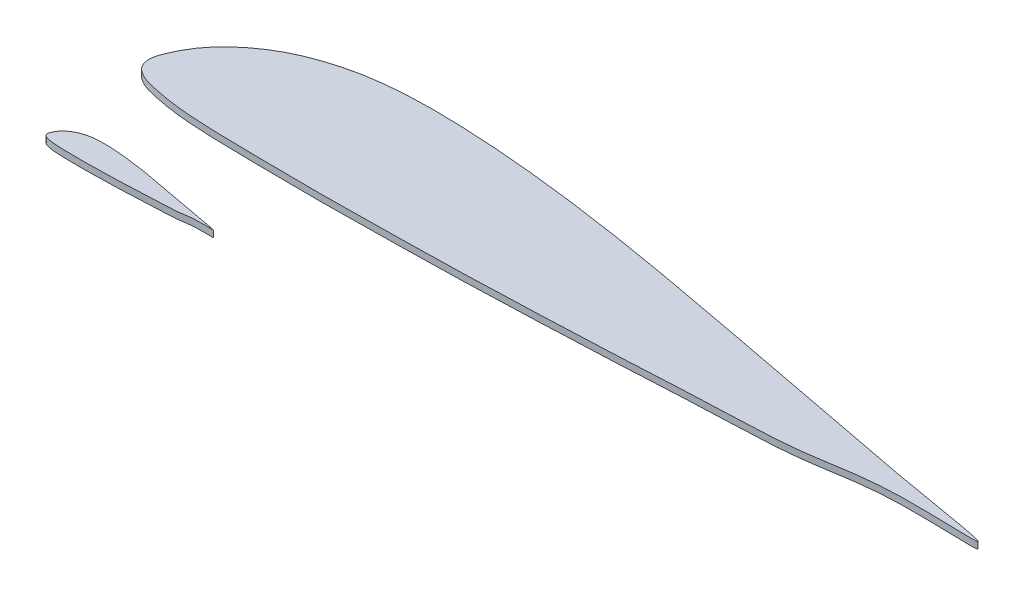
ISO-10303-21;
HEADER;
FILE_DESCRIPTION(('STEP AP214'),'2;1');
FILE_NAME('part.step','',(''),(''),'','','');
FILE_SCHEMA(('AUTOMOTIVE_DESIGN { 1 0 10303 214 1 1 1 1 }'));
ENDSEC;
DATA;
#1=APPLICATION_CONTEXT('core data for automotive mechanical design processes');
#2=APPLICATION_PROTOCOL_DEFINITION('international standard','automotive_design',2000,#1);
#3=PRODUCT_CONTEXT('',#1,'mechanical');
#4=PRODUCT('Part','Part','',(#3));
#5=PRODUCT_RELATED_PRODUCT_CATEGORY('part','',(#4));
#6=PRODUCT_DEFINITION_FORMATION('','',#4);
#7=PRODUCT_DEFINITION_CONTEXT('part definition',#1,'design');
#8=PRODUCT_DEFINITION('design','',#6,#7);
#9=PRODUCT_DEFINITION_SHAPE('','',#8);
#10=(LENGTH_UNIT() NAMED_UNIT(*) SI_UNIT(.MILLI.,.METRE.));
#11=(NAMED_UNIT(*) PLANE_ANGLE_UNIT() SI_UNIT($,.RADIAN.));
#12=(NAMED_UNIT(*) SI_UNIT($,.STERADIAN.) SOLID_ANGLE_UNIT());
#13=UNCERTAINTY_MEASURE_WITH_UNIT(LENGTH_MEASURE(1.E-05),#10,'distance_accuracy_value','');
#14=(GEOMETRIC_REPRESENTATION_CONTEXT(3) GLOBAL_UNCERTAINTY_ASSIGNED_CONTEXT((#13)) GLOBAL_UNIT_ASSIGNED_CONTEXT((#10,
#11,#12)) REPRESENTATION_CONTEXT('',''));
#15=CARTESIAN_POINT('',(0.,0.,0.));
#16=DIRECTION('',(0.,0.,1.));
#17=DIRECTION('',(1.,0.,0.));
#18=AXIS2_PLACEMENT_3D('',#15,#16,#17);
#19=CARTESIAN_POINT('',(492.,4.,-67.652117248356));
#20=CARTESIAN_POINT('',(492.314162404536,4.,-68.9072947029402));
#21=CARTESIAN_POINT('',(434.11891486913,4.,-78.0379749723945));
#22=CARTESIAN_POINT('',(394.11255435124,4.,-86.4188490323449));
#23=CARTESIAN_POINT('',(341.430867725912,4.,-96.1993323883618));
#24=CARTESIAN_POINT('',(292.193323671576,4.,-105.690867303714));
#25=CARTESIAN_POINT('',(242.083690153981,4.,-114.896091704618));
#26=CARTESIAN_POINT('',(192.163234967044,4.,-122.522241267517));
#27=CARTESIAN_POINT('',(150.407211882061,4.,-126.940203416063));
#28=CARTESIAN_POINT('',(117.018664623287,4.,-128.746128415345));
#29=CARTESIAN_POINT('',(91.956436712477,4.,-128.931625600867));
#30=CARTESIAN_POINT('',(66.6601337223384,4.,-126.809743558928));
#31=CARTESIAN_POINT('',(44.7634945351673,4.,-121.238091304056));
#32=CARTESIAN_POINT('',(28.1300732897793,4.,-113.97345871328));
#33=CARTESIAN_POINT('',(16.4707140551661,4.,-106.356619078859));
#34=CARTESIAN_POINT('',(8.13658587734449,4.,-99.162460727744));
#35=CARTESIAN_POINT('',(1.53788652412752,4.,-91.5749918664188));
#36=CARTESIAN_POINT('',(-2.5474332570886,4.,-85.2401321343158));
#37=CARTESIAN_POINT('',(-6.44447829791774,4.,-77.4008350974978));
#38=CARTESIAN_POINT('',(-9.37346606391106,4.,-69.591903303844));
#39=CARTESIAN_POINT('',(-6.38792599083984,4.,-62.7221609510061));
#40=CARTESIAN_POINT('',(-2.3595700708408,4.,-59.8857377541895));
#41=CARTESIAN_POINT('',(1.80371536292615,4.,-57.7501062352442));
#42=CARTESIAN_POINT('',(8.62537899468902,4.,-56.0801226558703));
#43=CARTESIAN_POINT('',(16.942374292905,4.,-54.3945200412575));
#44=CARTESIAN_POINT('',(28.6294674113893,4.,-52.847968383861));
#45=CARTESIAN_POINT('',(45.3135113769382,4.,-51.7356264625013));
#46=CARTESIAN_POINT('',(66.9987158478796,4.,-51.390567635409));
#47=CARTESIAN_POINT('',(91.9985119168434,4.,-51.0621635683304));
#48=CARTESIAN_POINT('',(117.001520916576,4.,-50.9735426737419));
#49=CARTESIAN_POINT('',(150.333059134976,4.,-51.4840388146242));
#50=CARTESIAN_POINT('',(192.02270905948,4.,-52.0581032856986));
#51=CARTESIAN_POINT('',(241.968513652882,4.,-53.9125317109954));
#52=CARTESIAN_POINT('',(292.16035736171,4.,-56.0067205783753));
#53=CARTESIAN_POINT('',(341.436299225028,4.,-58.9756495911982));
#54=CARTESIAN_POINT('',(394.250908778412,4.,-60.0076382988969));
#55=CARTESIAN_POINT('',(434.087300725326,4.,-70.3569688151884));
#56=CARTESIAN_POINT('',(491.691359171975,4.,-66.4190002257326));
#57=CARTESIAN_POINT('',(492.,4.,-67.652117248356));
#58=B_SPLINE_CURVE_WITH_KNOTS('',3,(#19,#20,#21,#22,#23,#24,#25,#26,#27,#28,#29,#30,#31,#32,#33,
#34,#35,#36,#37,#38,#39,#40,#41,#42,#43,#44,#45,#46,#47,#48,#49,#50,#51,#52,#53,#54,#55,#56,
#57),.UNSPECIFIED.,.T.,.F.,(4,1,1,1,1,1,1,1,1,1,1,1,1,1,1,1,1,1,1,1,1,1,1,1,1,1,1,1,1,1,1,1,1,1,
1,1,4),(0.,0.0490408656764943,0.0980817313529888,0.147122597029483,0.196163462705978,
0.245116685545263,0.293834629256661,0.342263553193416,0.366385572960314,0.390475045746911,
0.414675268241992,0.439565651155836,0.455415352681607,0.466907823883372,0.479711554297044,
0.48709032929319,0.495936907344408,0.501323477213704,0.512663454203477,0.518310059511212,
0.521365151754157,0.526751721623454,0.531754914327112,0.541581529671993,0.551304728452871,
0.565797224363326,0.589894838016151,0.613986045182352,0.638075566147846,0.662166773314048,
0.710353523244322,0.758560308204798,0.806785868446715,0.85502500010905,0.903284914630983,
0.951821054426205,1.),.UNSPECIFIED.);
#59=DIRECTION('',(0.,-1.,0.));
#60=VECTOR('',#59,1.);
#61=SURFACE_OF_LINEAR_EXTRUSION('',#58,#60);
#62=CARTESIAN_POINT('',(492.,4.,-67.652117248356));
#63=VERTEX_POINT('',#62);
#64=EDGE_CURVE('E11',#63,#63,#58,.T.);
#65=ORIENTED_EDGE('',*,*,#64,.F.);
#66=EDGE_LOOP('',(#65));
#67=FACE_BOUND('',#66,.T.);
#68=CARTESIAN_POINT('',(492.,0.,-67.652117248356));
#69=CARTESIAN_POINT('',(492.314162404536,0.,-68.9072947029402));
#70=CARTESIAN_POINT('',(434.11891486913,0.,-78.0379749723945));
#71=CARTESIAN_POINT('',(394.11255435124,0.,-86.4188490323449));
#72=CARTESIAN_POINT('',(341.430867725912,0.,-96.1993323883618));
#73=CARTESIAN_POINT('',(292.193323671576,0.,-105.690867303714));
#74=CARTESIAN_POINT('',(242.083690153981,0.,-114.896091704618));
#75=CARTESIAN_POINT('',(192.163234967044,0.,-122.522241267517));
#76=CARTESIAN_POINT('',(150.407211882061,0.,-126.940203416063));
#77=CARTESIAN_POINT('',(117.018664623287,0.,-128.746128415345));
#78=CARTESIAN_POINT('',(91.956436712477,0.,-128.931625600867));
#79=CARTESIAN_POINT('',(66.6601337223384,0.,-126.809743558928));
#80=CARTESIAN_POINT('',(44.7634945351673,0.,-121.238091304056));
#81=CARTESIAN_POINT('',(28.1300732897793,0.,-113.97345871328));
#82=CARTESIAN_POINT('',(16.4707140551661,0.,-106.356619078859));
#83=CARTESIAN_POINT('',(8.13658587734449,0.,-99.162460727744));
#84=CARTESIAN_POINT('',(1.53788652412752,0.,-91.5749918664188));
#85=CARTESIAN_POINT('',(-2.5474332570886,0.,-85.2401321343158));
#86=CARTESIAN_POINT('',(-6.44447829791774,0.,-77.4008350974978));
#87=CARTESIAN_POINT('',(-9.37346606391106,0.,-69.591903303844));
#88=CARTESIAN_POINT('',(-6.38792599083984,0.,-62.7221609510061));
#89=CARTESIAN_POINT('',(-2.3595700708408,0.,-59.8857377541895));
#90=CARTESIAN_POINT('',(1.80371536292615,0.,-57.7501062352442));
#91=CARTESIAN_POINT('',(8.62537899468902,0.,-56.0801226558703));
#92=CARTESIAN_POINT('',(16.942374292905,0.,-54.3945200412575));
#93=CARTESIAN_POINT('',(28.6294674113893,0.,-52.847968383861));
#94=CARTESIAN_POINT('',(45.3135113769382,0.,-51.7356264625013));
#95=CARTESIAN_POINT('',(66.9987158478796,0.,-51.390567635409));
#96=CARTESIAN_POINT('',(91.9985119168434,0.,-51.0621635683304));
#97=CARTESIAN_POINT('',(117.001520916576,0.,-50.9735426737419));
#98=CARTESIAN_POINT('',(150.333059134976,0.,-51.4840388146242));
#99=CARTESIAN_POINT('',(192.02270905948,0.,-52.0581032856986));
#100=CARTESIAN_POINT('',(241.968513652882,0.,-53.9125317109954));
#101=CARTESIAN_POINT('',(292.16035736171,0.,-56.0067205783753));
#102=CARTESIAN_POINT('',(341.436299225028,0.,-58.9756495911982));
#103=CARTESIAN_POINT('',(394.250908778412,0.,-60.0076382988969));
#104=CARTESIAN_POINT('',(434.087300725326,0.,-70.3569688151884));
#105=CARTESIAN_POINT('',(491.691359171975,0.,-66.4190002257326));
#106=CARTESIAN_POINT('',(492.,0.,-67.652117248356));
#107=B_SPLINE_CURVE_WITH_KNOTS('',3,(#68,#69,#70,#71,#72,#73,#74,#75,#76,#77,#78,#79,#80,#81,
#82,#83,#84,#85,#86,#87,#88,#89,#90,#91,#92,#93,#94,#95,#96,#97,#98,#99,#100,#101,#102,#103,
#104,#105,#106),.UNSPECIFIED.,.T.,.F.,(4,1,1,1,1,1,1,1,1,1,1,1,1,1,1,1,1,1,1,1,1,1,1,1,1,1,1,1,
1,1,1,1,1,1,1,1,4),(0.,0.0490408656764943,0.0980817313529888,0.147122597029483,
0.196163462705978,0.245116685545263,0.293834629256661,0.342263553193416,0.366385572960314,
0.390475045746911,0.414675268241992,0.439565651155836,0.455415352681607,0.466907823883372,
0.479711554297044,0.48709032929319,0.495936907344408,0.501323477213704,0.512663454203477,
0.518310059511212,0.521365151754157,0.526751721623454,0.531754914327112,0.541581529671993,
0.551304728452871,0.565797224363326,0.589894838016151,0.613986045182352,0.638075566147846,
0.662166773314048,0.710353523244322,0.758560308204798,0.806785868446715,0.85502500010905,
0.903284914630983,0.951821054426205,1.),.UNSPECIFIED.);
#108=CARTESIAN_POINT('',(492.,0.,-67.652117248356));
#109=VERTEX_POINT('',#108);
#110=EDGE_CURVE('E43',#109,#109,#107,.T.);
#111=ORIENTED_EDGE('',*,*,#110,.T.);
#112=EDGE_LOOP('',(#111));
#113=FACE_BOUND('',#112,.T.);
#114=ADVANCED_FACE('F39',(#67,#113),#61,.F.);
#115=CARTESIAN_POINT('',(-4.91510725042875,4.,-80.4108952612956));
#116=DIRECTION('',(0.,-1.,0.));
#117=DIRECTION('',(0.,0.,-1.));
#118=AXIS2_PLACEMENT_3D('',#115,#116,#117);
#119=PLANE('',#118);
#120=ORIENTED_EDGE('',*,*,#64,.T.);
#121=EDGE_LOOP('',(#120));
#122=FACE_BOUND('',#121,.T.);
#123=ADVANCED_FACE('F62',(#122),#119,.F.);
#124=CARTESIAN_POINT('',(-4.91510725042875,0.,-80.4108952612956));
#125=DIRECTION('',(0.,-1.,0.));
#126=DIRECTION('',(0.,0.,-1.));
#127=AXIS2_PLACEMENT_3D('',#124,#125,#126);
#128=PLANE('',#127);
#129=ORIENTED_EDGE('',*,*,#110,.F.);
#130=EDGE_LOOP('',(#129));
#131=FACE_BOUND('',#130,.T.);
#132=ADVANCED_FACE('F60',(#131),#128,.T.);
#133=CLOSED_SHELL('',(#114,#123,#132));
#134=MANIFOLD_SOLID_BREP('B2',#133);
#135=CARTESIAN_POINT('',(100.,4.,0.));
#136=CARTESIAN_POINT('',(100.062832480907,4.,-0.251035490916847));
#137=CARTESIAN_POINT('',(88.4237829738261,4.,-2.0771715448077));
#138=CARTESIAN_POINT('',(80.4225108702479,4.,-3.75334635679778));
#139=CARTESIAN_POINT('',(69.8861735451824,4.,-5.70944302800117));
#140=CARTESIAN_POINT('',(60.0386647343152,4.,-7.60775001107157));
#141=CARTESIAN_POINT('',(50.0167380307963,4.,-9.4487948912524));
#142=CARTESIAN_POINT('',(40.0326469934087,4.,-10.9740248038323));
#143=CARTESIAN_POINT('',(31.6814423764122,4.,-11.8576172335413));
#144=CARTESIAN_POINT('',(25.0037329246573,4.,-12.2188022333978));
#145=CARTESIAN_POINT('',(19.9912873424954,4.,-12.2559016705021));
#146=CARTESIAN_POINT('',(14.9320267444677,4.,-11.8315252621144));
#147=CARTESIAN_POINT('',(10.5526989070335,4.,-10.71719481114));
#148=CARTESIAN_POINT('',(7.22601465795583,4.,-9.26426829298485));
#149=CARTESIAN_POINT('',(4.89414281103323,4.,-7.74090036610056));
#150=CARTESIAN_POINT('',(3.22731717546887,4.,-6.30206869587759));
#151=CARTESIAN_POINT('',(1.90757730482551,4.,-4.78457492361256));
#152=CARTESIAN_POINT('',(1.09051334858228,4.,-3.51760297719199));
#153=CARTESIAN_POINT('',(0.311104340416445,4.,-1.94974356982835));
#154=CARTESIAN_POINT('',(-0.274693212782225,4.,-0.38795721109765));
#155=CARTESIAN_POINT('',(0.32241480183204,4.,0.985991259469997));
#156=CARTESIAN_POINT('',(1.12808598583183,4.,1.55327589883329));
#157=CARTESIAN_POINT('',(1.96074307258525,4.,1.98040220262235));
#158=CARTESIAN_POINT('',(3.32507579893781,4.,2.31439891849714));
#159=CARTESIAN_POINT('',(4.98847485858098,4.,2.6515194414197));
#160=CARTESIAN_POINT('',(7.32589348227786,4.,2.96082977289899));
#161=CARTESIAN_POINT('',(10.6627022753876,4.,3.18329815717093));
#162=CARTESIAN_POINT('',(14.9997431695759,4.,3.25230992258939));
#163=CARTESIAN_POINT('',(19.9997023833687,4.,3.31799073600512));
#164=CARTESIAN_POINT('',(25.0003041833152,4.,3.33571491492282));
#165=CARTESIAN_POINT('',(31.6666118269951,4.,3.23361568674636));
#166=CARTESIAN_POINT('',(40.0045418118961,4.,3.11880279253148));
#167=CARTESIAN_POINT('',(49.9937027305764,4.,2.7479171074721));
#168=CARTESIAN_POINT('',(60.032071472342,4.,2.32907933399613));
#169=CARTESIAN_POINT('',(69.8872598450056,4.,1.73529353143155));
#170=CARTESIAN_POINT('',(80.4501817556825,4.,1.52889578989182));
#171=CARTESIAN_POINT('',(88.4174601450651,4.,-0.540970313366487));
#172=CARTESIAN_POINT('',(99.9382718343949,4.,0.246623404524664));
#173=CARTESIAN_POINT('',(100.,4.,0.));
#174=B_SPLINE_CURVE_WITH_KNOTS('',3,(#135,#136,#137,#138,#139,#140,#141,#142,#143,#144,#145,
#146,#147,#148,#149,#150,#151,#152,#153,#154,#155,#156,#157,#158,#159,#160,#161,#162,#163,#164,
#165,#166,#167,#168,#169,#170,#171,#172,#173),.UNSPECIFIED.,.T.,.F.,(4,1,1,1,1,1,1,1,1,1,1,1,1,
1,1,1,1,1,1,1,1,1,1,1,1,1,1,1,1,1,1,1,1,1,1,1,4),(0.,0.0490408656764944,0.0980817313529888,
0.147122597029483,0.196163462705978,0.245116685545263,0.293834629256661,0.342263553193416,
0.366385572960314,0.390475045746911,0.414675268241992,0.439565651155836,0.455415352681607,
0.466907823883372,0.479711554297043,0.48709032929319,0.495936907344408,0.501323477213704,
0.512663454203477,0.518310059511212,0.521365151754157,0.526751721623454,0.531754914327112,
0.541581529671993,0.551304728452871,0.565797224363326,0.589894838016151,0.613986045182352,
0.638075566147846,0.662166773314048,0.710353523244322,0.758560308204797,0.806785868446715,
0.85502500010905,0.903284914630982,0.951821054426205,1.),.UNSPECIFIED.);
#175=DIRECTION('',(0.,-1.,0.));
#176=VECTOR('',#175,1.);
#177=SURFACE_OF_LINEAR_EXTRUSION('',#174,#176);
#178=CARTESIAN_POINT('',(100.,4.,0.));
#179=VERTEX_POINT('',#178);
#180=EDGE_CURVE('E38',#179,#179,#174,.T.);
#181=ORIENTED_EDGE('',*,*,#180,.F.);
#182=EDGE_LOOP('',(#181));
#183=FACE_BOUND('',#182,.T.);
#184=CARTESIAN_POINT('',(100.,0.,0.));
#185=CARTESIAN_POINT('',(100.062832480907,0.,-0.251035490916847));
#186=CARTESIAN_POINT('',(88.4237829738261,0.,-2.0771715448077));
#187=CARTESIAN_POINT('',(80.4225108702479,0.,-3.75334635679778));
#188=CARTESIAN_POINT('',(69.8861735451824,0.,-5.70944302800117));
#189=CARTESIAN_POINT('',(60.0386647343152,0.,-7.60775001107157));
#190=CARTESIAN_POINT('',(50.0167380307963,0.,-9.4487948912524));
#191=CARTESIAN_POINT('',(40.0326469934087,0.,-10.9740248038323));
#192=CARTESIAN_POINT('',(31.6814423764122,0.,-11.8576172335413));
#193=CARTESIAN_POINT('',(25.0037329246573,0.,-12.2188022333978));
#194=CARTESIAN_POINT('',(19.9912873424954,0.,-12.2559016705021));
#195=CARTESIAN_POINT('',(14.9320267444677,0.,-11.8315252621144));
#196=CARTESIAN_POINT('',(10.5526989070335,0.,-10.71719481114));
#197=CARTESIAN_POINT('',(7.22601465795583,0.,-9.26426829298485));
#198=CARTESIAN_POINT('',(4.89414281103323,0.,-7.74090036610056));
#199=CARTESIAN_POINT('',(3.22731717546887,0.,-6.30206869587759));
#200=CARTESIAN_POINT('',(1.90757730482551,0.,-4.78457492361256));
#201=CARTESIAN_POINT('',(1.09051334858228,0.,-3.51760297719199));
#202=CARTESIAN_POINT('',(0.311104340416445,0.,-1.94974356982835));
#203=CARTESIAN_POINT('',(-0.274693212782225,0.,-0.38795721109765));
#204=CARTESIAN_POINT('',(0.32241480183204,0.,0.985991259469997));
#205=CARTESIAN_POINT('',(1.12808598583183,0.,1.55327589883329));
#206=CARTESIAN_POINT('',(1.96074307258525,0.,1.98040220262235));
#207=CARTESIAN_POINT('',(3.32507579893781,0.,2.31439891849714));
#208=CARTESIAN_POINT('',(4.98847485858098,0.,2.6515194414197));
#209=CARTESIAN_POINT('',(7.32589348227786,0.,2.96082977289899));
#210=CARTESIAN_POINT('',(10.6627022753876,0.,3.18329815717093));
#211=CARTESIAN_POINT('',(14.9997431695759,0.,3.25230992258939));
#212=CARTESIAN_POINT('',(19.9997023833687,0.,3.31799073600512));
#213=CARTESIAN_POINT('',(25.0003041833152,0.,3.33571491492282));
#214=CARTESIAN_POINT('',(31.6666118269951,0.,3.23361568674636));
#215=CARTESIAN_POINT('',(40.0045418118961,0.,3.11880279253148));
#216=CARTESIAN_POINT('',(49.9937027305764,0.,2.7479171074721));
#217=CARTESIAN_POINT('',(60.032071472342,0.,2.32907933399613));
#218=CARTESIAN_POINT('',(69.8872598450056,0.,1.73529353143155));
#219=CARTESIAN_POINT('',(80.4501817556825,0.,1.52889578989182));
#220=CARTESIAN_POINT('',(88.4174601450651,0.,-0.540970313366487));
#221=CARTESIAN_POINT('',(99.9382718343949,0.,0.246623404524664));
#222=CARTESIAN_POINT('',(100.,0.,0.));
#223=B_SPLINE_CURVE_WITH_KNOTS('',3,(#184,#185,#186,#187,#188,#189,#190,#191,#192,#193,#194,
#195,#196,#197,#198,#199,#200,#201,#202,#203,#204,#205,#206,#207,#208,#209,#210,#211,#212,#213,
#214,#215,#216,#217,#218,#219,#220,#221,#222),.UNSPECIFIED.,.T.,.F.,(4,1,1,1,1,1,1,1,1,1,1,1,1,
1,1,1,1,1,1,1,1,1,1,1,1,1,1,1,1,1,1,1,1,1,1,1,4),(0.,0.0490408656764944,0.0980817313529888,
0.147122597029483,0.196163462705978,0.245116685545263,0.293834629256661,0.342263553193416,
0.366385572960314,0.390475045746911,0.414675268241992,0.439565651155836,0.455415352681607,
0.466907823883372,0.479711554297043,0.48709032929319,0.495936907344408,0.501323477213704,
0.512663454203477,0.518310059511212,0.521365151754157,0.526751721623454,0.531754914327112,
0.541581529671993,0.551304728452871,0.565797224363326,0.589894838016151,0.613986045182352,
0.638075566147846,0.662166773314048,0.710353523244322,0.758560308204797,0.806785868446715,
0.85502500010905,0.903284914630982,0.951821054426205,1.),.UNSPECIFIED.);
#224=CARTESIAN_POINT('',(100.,0.,0.));
#225=VERTEX_POINT('',#224);
#226=EDGE_CURVE('E95',#225,#225,#223,.T.);
#227=ORIENTED_EDGE('',*,*,#226,.T.);
#228=EDGE_LOOP('',(#227));
#229=FACE_BOUND('',#228,.T.);
#230=ADVANCED_FACE('F91',(#183,#229),#177,.F.);
#231=CARTESIAN_POINT('',(0.616978549914251,4.,-2.55175560258792));
#232=DIRECTION('',(0.,-1.,0.));
#233=DIRECTION('',(0.,0.,-1.));
#234=AXIS2_PLACEMENT_3D('',#231,#232,#233);
#235=PLANE('',#234);
#236=ORIENTED_EDGE('',*,*,#180,.T.);
#237=EDGE_LOOP('',(#236));
#238=FACE_BOUND('',#237,.T.);
#239=ADVANCED_FACE('F114',(#238),#235,.F.);
#240=CARTESIAN_POINT('',(0.616978549914251,0.,-2.55175560258792));
#241=DIRECTION('',(0.,-1.,0.));
#242=DIRECTION('',(0.,0.,-1.));
#243=AXIS2_PLACEMENT_3D('',#240,#241,#242);
#244=PLANE('',#243);
#245=ORIENTED_EDGE('',*,*,#226,.F.);
#246=EDGE_LOOP('',(#245));
#247=FACE_BOUND('',#246,.T.);
#248=ADVANCED_FACE('F112',(#247),#244,.T.);
#249=CLOSED_SHELL('',(#230,#239,#248));
#250=MANIFOLD_SOLID_BREP('B6',#249);
#251=ADVANCED_BREP_SHAPE_REPRESENTATION('',(#18,#134,#250),#14);
#252=SHAPE_DEFINITION_REPRESENTATION(#9,#251);
ENDSEC;
END-ISO-10303-21;
